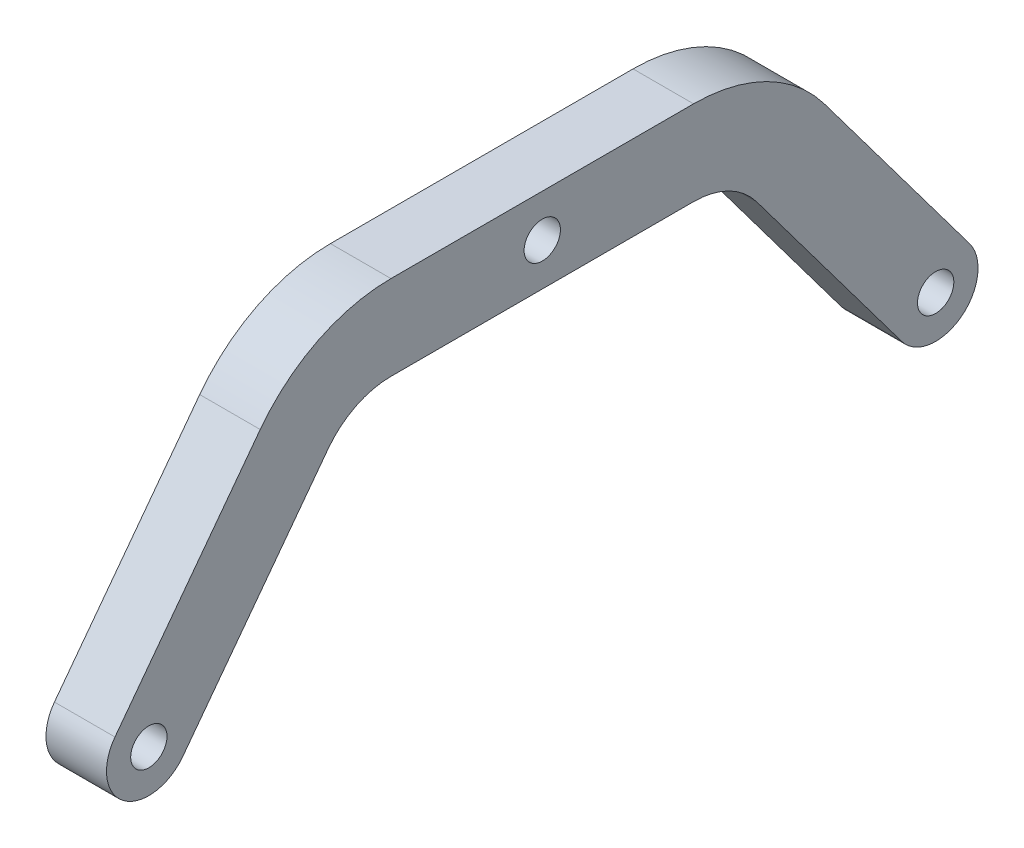
ISO-10303-21;
HEADER;
FILE_DESCRIPTION(('STEP AP214'),'2;1');
FILE_NAME('part.step','',(''),(''),'','','');
FILE_SCHEMA(('AUTOMOTIVE_DESIGN { 1 0 10303 214 1 1 1 1 }'));
ENDSEC;
DATA;
#1=APPLICATION_CONTEXT('core data for automotive mechanical design processes');
#2=APPLICATION_PROTOCOL_DEFINITION('international standard','automotive_design',2000,#1);
#3=PRODUCT_CONTEXT('',#1,'mechanical');
#4=PRODUCT('Part','Part','',(#3));
#5=PRODUCT_RELATED_PRODUCT_CATEGORY('part','',(#4));
#6=PRODUCT_DEFINITION_FORMATION('','',#4);
#7=PRODUCT_DEFINITION_CONTEXT('part definition',#1,'design');
#8=PRODUCT_DEFINITION('design','',#6,#7);
#9=PRODUCT_DEFINITION_SHAPE('','',#8);
#10=(LENGTH_UNIT() NAMED_UNIT(*) SI_UNIT(.MILLI.,.METRE.));
#11=(NAMED_UNIT(*) PLANE_ANGLE_UNIT() SI_UNIT($,.RADIAN.));
#12=(NAMED_UNIT(*) SI_UNIT($,.STERADIAN.) SOLID_ANGLE_UNIT());
#13=UNCERTAINTY_MEASURE_WITH_UNIT(LENGTH_MEASURE(1.E-05),#10,'distance_accuracy_value','');
#14=(GEOMETRIC_REPRESENTATION_CONTEXT(3) GLOBAL_UNCERTAINTY_ASSIGNED_CONTEXT((#13)) GLOBAL_UNIT_ASSIGNED_CONTEXT((#10,
#11,#12)) REPRESENTATION_CONTEXT('',''));
#15=CARTESIAN_POINT('',(0.,0.,0.));
#16=DIRECTION('',(0.,0.,1.));
#17=DIRECTION('',(1.,0.,0.));
#18=AXIS2_PLACEMENT_3D('',#15,#16,#17);
#19=CARTESIAN_POINT('',(2.5,9.99999999999999,-12.5));
#20=DIRECTION('',(-1.,0.,0.));
#21=DIRECTION('',(0.,0.,1.));
#22=AXIS2_PLACEMENT_3D('',#19,#20,#21);
#23=PLANE('',#22);
#24=CARTESIAN_POINT('',(2.5,9.99999999999999,-12.5));
#25=DIRECTION('',(1.,0.,0.));
#26=DIRECTION('',(0.,0.,1.));
#27=AXIS2_PLACEMENT_3D('',#24,#25,#26);
#28=CIRCLE('',#27,13.5);
#29=CARTESIAN_POINT('',(2.5,18.1,-23.3));
#30=VERTEX_POINT('',#29);
#31=CARTESIAN_POINT('',(2.5,23.5,-12.5));
#32=VERTEX_POINT('',#31);
#33=EDGE_CURVE('E181',#30,#32,#28,.T.);
#34=ORIENTED_EDGE('',*,*,#33,.T.);
#35=DIRECTION('',(0.,0.,1.));
#36=VECTOR('',#35,1.);
#37=CARTESIAN_POINT('',(2.5,23.5,12.5));
#38=LINE('',#37,#36);
#39=CARTESIAN_POINT('',(2.5,23.5,12.5));
#40=VERTEX_POINT('',#39);
#41=EDGE_CURVE('E109',#32,#40,#38,.T.);
#42=ORIENTED_EDGE('',*,*,#41,.T.);
#43=CARTESIAN_POINT('',(2.5,9.99999999999999,12.5));
#44=DIRECTION('',(1.,0.,0.));
#45=DIRECTION('',(0.,0.,-1.));
#46=AXIS2_PLACEMENT_3D('',#43,#44,#45);
#47=CIRCLE('',#46,13.5);
#48=CARTESIAN_POINT('',(2.5,18.1,23.3));
#49=VERTEX_POINT('',#48);
#50=EDGE_CURVE('E208',#40,#49,#47,.T.);
#51=ORIENTED_EDGE('',*,*,#50,.T.);
#52=DIRECTION('',(0.,-0.8,0.6));
#53=VECTOR('',#52,1.);
#54=CARTESIAN_POINT('',(2.5,18.1,23.3));
#55=LINE('',#54,#53);
#56=CARTESIAN_POINT('',(2.5,2.1,35.3));
#57=VERTEX_POINT('',#56);
#58=EDGE_CURVE('E227',#49,#57,#55,.T.);
#59=ORIENTED_EDGE('',*,*,#58,.T.);
#60=CARTESIAN_POINT('',(2.5,0.,32.5));
#61=DIRECTION('',(1.,0.,0.));
#62=DIRECTION('',(0.,0.,-1.));
#63=AXIS2_PLACEMENT_3D('',#60,#61,#62);
#64=CIRCLE('',#63,3.5);
#65=CARTESIAN_POINT('',(2.5,-2.1,29.7));
#66=VERTEX_POINT('',#65);
#67=EDGE_CURVE('E224',#57,#66,#64,.T.);
#68=ORIENTED_EDGE('',*,*,#67,.T.);
#69=DIRECTION('',(0.,0.8,-0.6));
#70=VECTOR('',#69,1.);
#71=CARTESIAN_POINT('',(2.5,13.9,17.7));
#72=LINE('',#71,#70);
#73=CARTESIAN_POINT('',(2.5,13.9,17.7));
#74=VERTEX_POINT('',#73);
#75=EDGE_CURVE('E226',#66,#74,#72,.T.);
#76=ORIENTED_EDGE('',*,*,#75,.T.);
#77=CARTESIAN_POINT('',(2.5,9.99999999999999,12.5));
#78=DIRECTION('',(-1.,0.,0.));
#79=DIRECTION('',(0.,0.,-1.));
#80=AXIS2_PLACEMENT_3D('',#77,#78,#79);
#81=CIRCLE('',#80,6.50000000000001);
#82=CARTESIAN_POINT('',(2.5,16.5,12.5));
#83=VERTEX_POINT('',#82);
#84=EDGE_CURVE('E229',#74,#83,#81,.T.);
#85=ORIENTED_EDGE('',*,*,#84,.T.);
#86=DIRECTION('',(0.,0.,-1.));
#87=VECTOR('',#86,1.);
#88=CARTESIAN_POINT('',(2.5,16.5,12.5));
#89=LINE('',#88,#87);
#90=CARTESIAN_POINT('',(2.5,16.5,-12.5));
#91=VERTEX_POINT('',#90);
#92=EDGE_CURVE('E235',#83,#91,#89,.T.);
#93=ORIENTED_EDGE('',*,*,#92,.T.);
#94=CARTESIAN_POINT('',(2.5,9.99999999999999,-12.5));
#95=DIRECTION('',(-1.,0.,0.));
#96=DIRECTION('',(0.,0.,1.));
#97=AXIS2_PLACEMENT_3D('',#94,#95,#96);
#98=CIRCLE('',#97,6.5);
#99=CARTESIAN_POINT('',(2.5,13.9,-17.7));
#100=VERTEX_POINT('',#99);
#101=EDGE_CURVE('E140',#91,#100,#98,.T.);
#102=ORIENTED_EDGE('',*,*,#101,.T.);
#103=DIRECTION('',(0.,-0.8,-0.6));
#104=VECTOR('',#103,1.);
#105=CARTESIAN_POINT('',(2.5,13.9,-17.7));
#106=LINE('',#105,#104);
#107=CARTESIAN_POINT('',(2.5,-2.1,-29.7));
#108=VERTEX_POINT('',#107);
#109=EDGE_CURVE('E134',#100,#108,#106,.T.);
#110=ORIENTED_EDGE('',*,*,#109,.T.);
#111=CARTESIAN_POINT('',(2.5,0.,-32.5));
#112=DIRECTION('',(1.,0.,0.));
#113=DIRECTION('',(0.,0.,1.));
#114=AXIS2_PLACEMENT_3D('',#111,#112,#113);
#115=CIRCLE('',#114,3.5);
#116=CARTESIAN_POINT('',(2.5,2.1,-35.3));
#117=VERTEX_POINT('',#116);
#118=EDGE_CURVE('E138',#108,#117,#115,.T.);
#119=ORIENTED_EDGE('',*,*,#118,.T.);
#120=DIRECTION('',(0.,0.8,0.6));
#121=VECTOR('',#120,1.);
#122=CARTESIAN_POINT('',(2.5,18.1,-23.3));
#123=LINE('',#122,#121);
#124=EDGE_CURVE('E54',#117,#30,#123,.T.);
#125=ORIENTED_EDGE('',*,*,#124,.T.);
#126=EDGE_LOOP('',(#34,#42,#51,#59,#68,#76,#85,#93,#102,#110,#119,#125));
#127=FACE_BOUND('',#126,.T.);
#128=CARTESIAN_POINT('',(2.5,0.,-32.5));
#129=DIRECTION('',(1.,0.,0.));
#130=DIRECTION('',(0.,0.,-1.));
#131=AXIS2_PLACEMENT_3D('',#128,#129,#130);
#132=CIRCLE('',#131,1.5);
#133=CARTESIAN_POINT('',(2.5,0.,-34.));
#134=VERTEX_POINT('',#133);
#135=EDGE_CURVE('E162',#134,#134,#132,.T.);
#136=ORIENTED_EDGE('',*,*,#135,.F.);
#137=EDGE_LOOP('',(#136));
#138=FACE_BOUND('',#137,.T.);
#139=CARTESIAN_POINT('',(2.5,0.,32.5));
#140=DIRECTION('',(1.,0.,0.));
#141=DIRECTION('',(0.,0.,-1.));
#142=AXIS2_PLACEMENT_3D('',#139,#140,#141);
#143=CIRCLE('',#142,1.5);
#144=CARTESIAN_POINT('',(2.5,0.,31.));
#145=VERTEX_POINT('',#144);
#146=EDGE_CURVE('E289',#145,#145,#143,.T.);
#147=ORIENTED_EDGE('',*,*,#146,.F.);
#148=EDGE_LOOP('',(#147));
#149=FACE_BOUND('',#148,.T.);
#150=CARTESIAN_POINT('',(2.5,20.,0.));
#151=DIRECTION('',(1.,0.,0.));
#152=DIRECTION('',(0.,0.,-1.));
#153=AXIS2_PLACEMENT_3D('',#150,#151,#152);
#154=CIRCLE('',#153,1.5);
#155=CARTESIAN_POINT('',(2.5,20.,-1.5));
#156=VERTEX_POINT('',#155);
#157=EDGE_CURVE('E280',#156,#156,#154,.T.);
#158=ORIENTED_EDGE('',*,*,#157,.F.);
#159=EDGE_LOOP('',(#158));
#160=FACE_BOUND('',#159,.T.);
#161=ADVANCED_FACE('F37',(#127,#138,#149,#160),#23,.F.);
#162=CARTESIAN_POINT('',(-2.5,9.99999999999999,-12.5));
#163=DIRECTION('',(-1.,0.,0.));
#164=DIRECTION('',(0.,0.,1.));
#165=AXIS2_PLACEMENT_3D('',#162,#163,#164);
#166=PLANE('',#165);
#167=CARTESIAN_POINT('',(-2.5,0.,32.5));
#168=DIRECTION('',(1.,0.,0.));
#169=DIRECTION('',(0.,0.,-1.));
#170=AXIS2_PLACEMENT_3D('',#167,#168,#169);
#171=CIRCLE('',#170,1.5);
#172=CARTESIAN_POINT('',(-2.5,0.,31.));
#173=VERTEX_POINT('',#172);
#174=EDGE_CURVE('E286',#173,#173,#171,.T.);
#175=ORIENTED_EDGE('',*,*,#174,.T.);
#176=EDGE_LOOP('',(#175));
#177=FACE_BOUND('',#176,.T.);
#178=CARTESIAN_POINT('',(-2.5,9.99999999999999,-12.5));
#179=DIRECTION('',(1.,0.,0.));
#180=DIRECTION('',(0.,0.,1.));
#181=AXIS2_PLACEMENT_3D('',#178,#179,#180);
#182=CIRCLE('',#181,13.5);
#183=CARTESIAN_POINT('',(-2.5,18.1,-23.3));
#184=VERTEX_POINT('',#183);
#185=CARTESIAN_POINT('',(-2.5,23.5,-12.5));
#186=VERTEX_POINT('',#185);
#187=EDGE_CURVE('E158',#184,#186,#182,.T.);
#188=ORIENTED_EDGE('',*,*,#187,.F.);
#189=DIRECTION('',(0.,0.8,0.6));
#190=VECTOR('',#189,1.);
#191=CARTESIAN_POINT('',(-2.5,18.1,-23.3));
#192=LINE('',#191,#190);
#193=CARTESIAN_POINT('',(-2.5,2.1,-35.3));
#194=VERTEX_POINT('',#193);
#195=EDGE_CURVE('E101',#194,#184,#192,.T.);
#196=ORIENTED_EDGE('',*,*,#195,.F.);
#197=CARTESIAN_POINT('',(-2.5,0.,-32.5));
#198=DIRECTION('',(1.,0.,0.));
#199=DIRECTION('',(0.,0.,1.));
#200=AXIS2_PLACEMENT_3D('',#197,#198,#199);
#201=CIRCLE('',#200,3.5);
#202=CARTESIAN_POINT('',(-2.5,-2.1,-29.7));
#203=VERTEX_POINT('',#202);
#204=EDGE_CURVE('E95',#203,#194,#201,.T.);
#205=ORIENTED_EDGE('',*,*,#204,.F.);
#206=DIRECTION('',(0.,-0.8,-0.6));
#207=VECTOR('',#206,1.);
#208=CARTESIAN_POINT('',(-2.5,13.9,-17.7));
#209=LINE('',#208,#207);
#210=CARTESIAN_POINT('',(-2.5,13.9,-17.7));
#211=VERTEX_POINT('',#210);
#212=EDGE_CURVE('E148',#211,#203,#209,.T.);
#213=ORIENTED_EDGE('',*,*,#212,.F.);
#214=CARTESIAN_POINT('',(-2.5,9.99999999999999,-12.5));
#215=DIRECTION('',(-1.,0.,0.));
#216=DIRECTION('',(0.,0.,1.));
#217=AXIS2_PLACEMENT_3D('',#214,#215,#216);
#218=CIRCLE('',#217,6.5);
#219=CARTESIAN_POINT('',(-2.5,16.5,-12.5));
#220=VERTEX_POINT('',#219);
#221=EDGE_CURVE('E176',#220,#211,#218,.T.);
#222=ORIENTED_EDGE('',*,*,#221,.F.);
#223=DIRECTION('',(0.,0.,-1.));
#224=VECTOR('',#223,1.);
#225=CARTESIAN_POINT('',(-2.5,16.5,12.5));
#226=LINE('',#225,#224);
#227=CARTESIAN_POINT('',(-2.5,16.5,12.5));
#228=VERTEX_POINT('',#227);
#229=EDGE_CURVE('E174',#228,#220,#226,.T.);
#230=ORIENTED_EDGE('',*,*,#229,.F.);
#231=CARTESIAN_POINT('',(-2.5,9.99999999999999,12.5));
#232=DIRECTION('',(-1.,0.,0.));
#233=DIRECTION('',(0.,0.,-1.));
#234=AXIS2_PLACEMENT_3D('',#231,#232,#233);
#235=CIRCLE('',#234,6.50000000000001);
#236=CARTESIAN_POINT('',(-2.5,13.9,17.7));
#237=VERTEX_POINT('',#236);
#238=EDGE_CURVE('E172',#237,#228,#235,.T.);
#239=ORIENTED_EDGE('',*,*,#238,.F.);
#240=DIRECTION('',(0.,0.8,-0.6));
#241=VECTOR('',#240,1.);
#242=CARTESIAN_POINT('',(-2.5,13.9,17.7));
#243=LINE('',#242,#241);
#244=CARTESIAN_POINT('',(-2.5,-2.1,29.7));
#245=VERTEX_POINT('',#244);
#246=EDGE_CURVE('E170',#245,#237,#243,.T.);
#247=ORIENTED_EDGE('',*,*,#246,.F.);
#248=CARTESIAN_POINT('',(-2.5,0.,32.5));
#249=DIRECTION('',(1.,0.,0.));
#250=DIRECTION('',(0.,0.,-1.));
#251=AXIS2_PLACEMENT_3D('',#248,#249,#250);
#252=CIRCLE('',#251,3.5);
#253=CARTESIAN_POINT('',(-2.5,2.1,35.3));
#254=VERTEX_POINT('',#253);
#255=EDGE_CURVE('E168',#254,#245,#252,.T.);
#256=ORIENTED_EDGE('',*,*,#255,.F.);
#257=DIRECTION('',(0.,-0.8,0.6));
#258=VECTOR('',#257,1.);
#259=CARTESIAN_POINT('',(-2.5,18.1,23.3));
#260=LINE('',#259,#258);
#261=CARTESIAN_POINT('',(-2.5,18.1,23.3));
#262=VERTEX_POINT('',#261);
#263=EDGE_CURVE('E166',#262,#254,#260,.T.);
#264=ORIENTED_EDGE('',*,*,#263,.F.);
#265=CARTESIAN_POINT('',(-2.5,9.99999999999999,12.5));
#266=DIRECTION('',(1.,0.,0.));
#267=DIRECTION('',(0.,0.,-1.));
#268=AXIS2_PLACEMENT_3D('',#265,#266,#267);
#269=CIRCLE('',#268,13.5);
#270=CARTESIAN_POINT('',(-2.5,23.5,12.5));
#271=VERTEX_POINT('',#270);
#272=EDGE_CURVE('E164',#271,#262,#269,.T.);
#273=ORIENTED_EDGE('',*,*,#272,.F.);
#274=DIRECTION('',(0.,0.,1.));
#275=VECTOR('',#274,1.);
#276=CARTESIAN_POINT('',(-2.5,23.5,12.5));
#277=LINE('',#276,#275);
#278=EDGE_CURVE('E161',#186,#271,#277,.T.);
#279=ORIENTED_EDGE('',*,*,#278,.F.);
#280=EDGE_LOOP('',(#188,#196,#205,#213,#222,#230,#239,#247,#256,#264,#273,#279));
#281=FACE_BOUND('',#280,.T.);
#282=CARTESIAN_POINT('',(-2.5,0.,-32.5));
#283=DIRECTION('',(1.,0.,0.));
#284=DIRECTION('',(0.,0.,-1.));
#285=AXIS2_PLACEMENT_3D('',#282,#283,#284);
#286=CIRCLE('',#285,1.5);
#287=CARTESIAN_POINT('',(-2.5,0.,-34.));
#288=VERTEX_POINT('',#287);
#289=EDGE_CURVE('E292',#288,#288,#286,.T.);
#290=ORIENTED_EDGE('',*,*,#289,.T.);
#291=EDGE_LOOP('',(#290));
#292=FACE_BOUND('',#291,.T.);
#293=CARTESIAN_POINT('',(-2.5,20.,0.));
#294=DIRECTION('',(1.,0.,0.));
#295=DIRECTION('',(0.,0.,-1.));
#296=AXIS2_PLACEMENT_3D('',#293,#294,#295);
#297=CIRCLE('',#296,1.5);
#298=CARTESIAN_POINT('',(-2.5,20.,-1.5));
#299=VERTEX_POINT('',#298);
#300=EDGE_CURVE('E283',#299,#299,#297,.T.);
#301=ORIENTED_EDGE('',*,*,#300,.T.);
#302=EDGE_LOOP('',(#301));
#303=FACE_BOUND('',#302,.T.);
#304=ADVANCED_FACE('F212',(#177,#281,#292,#303),#166,.T.);
#305=CARTESIAN_POINT('',(2.5,9.99999999999999,-12.5));
#306=DIRECTION('',(-1.,0.,0.));
#307=DIRECTION('',(0.,0.,1.));
#308=AXIS2_PLACEMENT_3D('',#305,#306,#307);
#309=CYLINDRICAL_SURFACE('',#308,13.5);
#310=ORIENTED_EDGE('',*,*,#187,.T.);
#311=DIRECTION('',(-1.,0.,0.));
#312=VECTOR('',#311,1.);
#313=CARTESIAN_POINT('',(2.5,23.5,-12.5));
#314=LINE('',#313,#312);
#315=EDGE_CURVE('E11',#32,#186,#314,.T.);
#316=ORIENTED_EDGE('',*,*,#315,.F.);
#317=ORIENTED_EDGE('',*,*,#33,.F.);
#318=DIRECTION('',(-1.,0.,0.));
#319=VECTOR('',#318,1.);
#320=CARTESIAN_POINT('',(2.5,18.1,-23.3));
#321=LINE('',#320,#319);
#322=EDGE_CURVE('E154',#30,#184,#321,.T.);
#323=ORIENTED_EDGE('',*,*,#322,.T.);
#324=EDGE_LOOP('',(#310,#316,#317,#323));
#325=FACE_BOUND('',#324,.T.);
#326=ADVANCED_FACE('F39',(#325),#309,.T.);
#327=CARTESIAN_POINT('',(2.5,23.5,12.5));
#328=DIRECTION('',(0.,-1.,0.));
#329=DIRECTION('',(0.,0.,-1.));
#330=AXIS2_PLACEMENT_3D('',#327,#328,#329);
#331=PLANE('',#330);
#332=ORIENTED_EDGE('',*,*,#278,.T.);
#333=DIRECTION('',(-1.,0.,0.));
#334=VECTOR('',#333,1.);
#335=CARTESIAN_POINT('',(2.5,23.5,12.5));
#336=LINE('',#335,#334);
#337=EDGE_CURVE('E46',#40,#271,#336,.T.);
#338=ORIENTED_EDGE('',*,*,#337,.F.);
#339=ORIENTED_EDGE('',*,*,#41,.F.);
#340=ORIENTED_EDGE('',*,*,#315,.T.);
#341=EDGE_LOOP('',(#332,#338,#339,#340));
#342=FACE_BOUND('',#341,.T.);
#343=ADVANCED_FACE('F405',(#342),#331,.F.);
#344=CARTESIAN_POINT('',(2.5,9.99999999999999,12.5));
#345=DIRECTION('',(-1.,0.,0.));
#346=DIRECTION('',(0.,0.,1.));
#347=AXIS2_PLACEMENT_3D('',#344,#345,#346);
#348=CYLINDRICAL_SURFACE('',#347,13.5);
#349=ORIENTED_EDGE('',*,*,#272,.T.);
#350=DIRECTION('',(-1.,0.,0.));
#351=VECTOR('',#350,1.);
#352=CARTESIAN_POINT('',(2.5,18.1,23.3));
#353=LINE('',#352,#351);
#354=EDGE_CURVE('E200',#49,#262,#353,.T.);
#355=ORIENTED_EDGE('',*,*,#354,.F.);
#356=ORIENTED_EDGE('',*,*,#50,.F.);
#357=ORIENTED_EDGE('',*,*,#337,.T.);
#358=EDGE_LOOP('',(#349,#355,#356,#357));
#359=FACE_BOUND('',#358,.T.);
#360=ADVANCED_FACE('F206',(#359),#348,.T.);
#361=CARTESIAN_POINT('',(2.5,18.1,23.3));
#362=DIRECTION('',(0.,-0.6,-0.8));
#363=DIRECTION('',(0.,0.8,-0.6));
#364=AXIS2_PLACEMENT_3D('',#361,#362,#363);
#365=PLANE('',#364);
#366=ORIENTED_EDGE('',*,*,#263,.T.);
#367=DIRECTION('',(-1.,0.,0.));
#368=VECTOR('',#367,1.);
#369=CARTESIAN_POINT('',(2.5,2.1,35.3));
#370=LINE('',#369,#368);
#371=EDGE_CURVE('E197',#57,#254,#370,.T.);
#372=ORIENTED_EDGE('',*,*,#371,.F.);
#373=ORIENTED_EDGE('',*,*,#58,.F.);
#374=ORIENTED_EDGE('',*,*,#354,.T.);
#375=EDGE_LOOP('',(#366,#372,#373,#374));
#376=FACE_BOUND('',#375,.T.);
#377=ADVANCED_FACE('F218',(#376),#365,.F.);
#378=CARTESIAN_POINT('',(2.5,0.,32.5));
#379=DIRECTION('',(-1.,0.,0.));
#380=DIRECTION('',(0.,0.,1.));
#381=AXIS2_PLACEMENT_3D('',#378,#379,#380);
#382=CYLINDRICAL_SURFACE('',#381,3.5);
#383=ORIENTED_EDGE('',*,*,#255,.T.);
#384=DIRECTION('',(-1.,0.,0.));
#385=VECTOR('',#384,1.);
#386=CARTESIAN_POINT('',(2.5,-2.1,29.7));
#387=LINE('',#386,#385);
#388=EDGE_CURVE('E194',#66,#245,#387,.T.);
#389=ORIENTED_EDGE('',*,*,#388,.F.);
#390=ORIENTED_EDGE('',*,*,#67,.F.);
#391=ORIENTED_EDGE('',*,*,#371,.T.);
#392=EDGE_LOOP('',(#383,#389,#390,#391));
#393=FACE_BOUND('',#392,.T.);
#394=ADVANCED_FACE('F222',(#393),#382,.T.);
#395=CARTESIAN_POINT('',(2.5,13.9,17.7));
#396=DIRECTION('',(0.,0.6,0.8));
#397=DIRECTION('',(0.,-0.8,0.6));
#398=AXIS2_PLACEMENT_3D('',#395,#396,#397);
#399=PLANE('',#398);
#400=ORIENTED_EDGE('',*,*,#246,.T.);
#401=DIRECTION('',(-1.,0.,0.));
#402=VECTOR('',#401,1.);
#403=CARTESIAN_POINT('',(2.5,13.9,17.7));
#404=LINE('',#403,#402);
#405=EDGE_CURVE('E191',#74,#237,#404,.T.);
#406=ORIENTED_EDGE('',*,*,#405,.F.);
#407=ORIENTED_EDGE('',*,*,#75,.F.);
#408=ORIENTED_EDGE('',*,*,#388,.T.);
#409=EDGE_LOOP('',(#400,#406,#407,#408));
#410=FACE_BOUND('',#409,.T.);
#411=ADVANCED_FACE('F366',(#410),#399,.F.);
#412=CARTESIAN_POINT('',(2.5,9.99999999999999,12.5));
#413=DIRECTION('',(-1.,0.,0.));
#414=DIRECTION('',(0.,0.,1.));
#415=AXIS2_PLACEMENT_3D('',#412,#413,#414);
#416=CYLINDRICAL_SURFACE('',#415,6.50000000000001);
#417=ORIENTED_EDGE('',*,*,#238,.T.);
#418=DIRECTION('',(-1.,0.,0.));
#419=VECTOR('',#418,1.);
#420=CARTESIAN_POINT('',(2.5,16.5,12.5));
#421=LINE('',#420,#419);
#422=EDGE_CURVE('E188',#83,#228,#421,.T.);
#423=ORIENTED_EDGE('',*,*,#422,.F.);
#424=ORIENTED_EDGE('',*,*,#84,.F.);
#425=ORIENTED_EDGE('',*,*,#405,.T.);
#426=EDGE_LOOP('',(#417,#423,#424,#425));
#427=FACE_BOUND('',#426,.T.);
#428=ADVANCED_FACE('F356',(#427),#416,.F.);
#429=CARTESIAN_POINT('',(2.5,16.5,12.5));
#430=DIRECTION('',(0.,1.,0.));
#431=DIRECTION('',(0.,0.,1.));
#432=AXIS2_PLACEMENT_3D('',#429,#430,#431);
#433=PLANE('',#432);
#434=ORIENTED_EDGE('',*,*,#229,.T.);
#435=DIRECTION('',(-1.,0.,0.));
#436=VECTOR('',#435,1.);
#437=CARTESIAN_POINT('',(2.5,16.5,-12.5));
#438=LINE('',#437,#436);
#439=EDGE_CURVE('E185',#91,#220,#438,.T.);
#440=ORIENTED_EDGE('',*,*,#439,.F.);
#441=ORIENTED_EDGE('',*,*,#92,.F.);
#442=ORIENTED_EDGE('',*,*,#422,.T.);
#443=EDGE_LOOP('',(#434,#440,#441,#442));
#444=FACE_BOUND('',#443,.T.);
#445=ADVANCED_FACE('F241',(#444),#433,.F.);
#446=CARTESIAN_POINT('',(2.5,9.99999999999999,-12.5));
#447=DIRECTION('',(-1.,0.,0.));
#448=DIRECTION('',(0.,0.,1.));
#449=AXIS2_PLACEMENT_3D('',#446,#447,#448);
#450=CYLINDRICAL_SURFACE('',#449,6.5);
#451=ORIENTED_EDGE('',*,*,#221,.T.);
#452=DIRECTION('',(-1.,0.,0.));
#453=VECTOR('',#452,1.);
#454=CARTESIAN_POINT('',(2.5,13.9,-17.7));
#455=LINE('',#454,#453);
#456=EDGE_CURVE('E149',#100,#211,#455,.T.);
#457=ORIENTED_EDGE('',*,*,#456,.F.);
#458=ORIENTED_EDGE('',*,*,#101,.F.);
#459=ORIENTED_EDGE('',*,*,#439,.T.);
#460=EDGE_LOOP('',(#451,#457,#458,#459));
#461=FACE_BOUND('',#460,.T.);
#462=ADVANCED_FACE('F245',(#461),#450,.F.);
#463=CARTESIAN_POINT('',(2.5,13.9,-17.7));
#464=DIRECTION('',(0.,0.6,-0.8));
#465=DIRECTION('',(0.,0.8,0.6));
#466=AXIS2_PLACEMENT_3D('',#463,#464,#465);
#467=PLANE('',#466);
#468=ORIENTED_EDGE('',*,*,#212,.T.);
#469=DIRECTION('',(-1.,0.,0.));
#470=VECTOR('',#469,1.);
#471=CARTESIAN_POINT('',(2.5,-2.1,-29.7));
#472=LINE('',#471,#470);
#473=EDGE_CURVE('E145',#108,#203,#472,.T.);
#474=ORIENTED_EDGE('',*,*,#473,.F.);
#475=ORIENTED_EDGE('',*,*,#109,.F.);
#476=ORIENTED_EDGE('',*,*,#456,.T.);
#477=EDGE_LOOP('',(#468,#474,#475,#476));
#478=FACE_BOUND('',#477,.T.);
#479=ADVANCED_FACE('F146',(#478),#467,.F.);
#480=CARTESIAN_POINT('',(2.5,0.,-32.5));
#481=DIRECTION('',(-1.,0.,0.));
#482=DIRECTION('',(0.,0.,1.));
#483=AXIS2_PLACEMENT_3D('',#480,#481,#482);
#484=CYLINDRICAL_SURFACE('',#483,3.5);
#485=ORIENTED_EDGE('',*,*,#204,.T.);
#486=DIRECTION('',(-1.,0.,0.));
#487=VECTOR('',#486,1.);
#488=CARTESIAN_POINT('',(2.5,2.1,-35.3));
#489=LINE('',#488,#487);
#490=EDGE_CURVE('E150',#117,#194,#489,.T.);
#491=ORIENTED_EDGE('',*,*,#490,.F.);
#492=ORIENTED_EDGE('',*,*,#118,.F.);
#493=ORIENTED_EDGE('',*,*,#473,.T.);
#494=EDGE_LOOP('',(#485,#491,#492,#493));
#495=FACE_BOUND('',#494,.T.);
#496=ADVANCED_FACE('F152',(#495),#484,.T.);
#497=CARTESIAN_POINT('',(2.5,18.1,-23.3));
#498=DIRECTION('',(0.,-0.6,0.8));
#499=DIRECTION('',(0.,-0.8,-0.6));
#500=AXIS2_PLACEMENT_3D('',#497,#498,#499);
#501=PLANE('',#500);
#502=ORIENTED_EDGE('',*,*,#195,.T.);
#503=ORIENTED_EDGE('',*,*,#322,.F.);
#504=ORIENTED_EDGE('',*,*,#124,.F.);
#505=ORIENTED_EDGE('',*,*,#490,.T.);
#506=EDGE_LOOP('',(#502,#503,#504,#505));
#507=FACE_BOUND('',#506,.T.);
#508=ADVANCED_FACE('F249',(#507),#501,.F.);
#509=CARTESIAN_POINT('',(2.5,0.,-32.5));
#510=DIRECTION('',(-1.,0.,0.));
#511=DIRECTION('',(0.,0.,1.));
#512=AXIS2_PLACEMENT_3D('',#509,#510,#511);
#513=CYLINDRICAL_SURFACE('',#512,1.5);
#514=ORIENTED_EDGE('',*,*,#135,.T.);
#515=EDGE_LOOP('',(#514));
#516=FACE_BOUND('',#515,.T.);
#517=ORIENTED_EDGE('',*,*,#289,.F.);
#518=EDGE_LOOP('',(#517));
#519=FACE_BOUND('',#518,.T.);
#520=ADVANCED_FACE('F251',(#516,#519),#513,.F.);
#521=CARTESIAN_POINT('',(2.5,0.,32.5));
#522=DIRECTION('',(-1.,0.,0.));
#523=DIRECTION('',(0.,0.,1.));
#524=AXIS2_PLACEMENT_3D('',#521,#522,#523);
#525=CYLINDRICAL_SURFACE('',#524,1.5);
#526=ORIENTED_EDGE('',*,*,#146,.T.);
#527=EDGE_LOOP('',(#526));
#528=FACE_BOUND('',#527,.T.);
#529=ORIENTED_EDGE('',*,*,#174,.F.);
#530=EDGE_LOOP('',(#529));
#531=FACE_BOUND('',#530,.T.);
#532=ADVANCED_FACE('F257',(#528,#531),#525,.F.);
#533=CARTESIAN_POINT('',(2.5,20.,0.));
#534=DIRECTION('',(-1.,0.,0.));
#535=DIRECTION('',(0.,0.,1.));
#536=AXIS2_PLACEMENT_3D('',#533,#534,#535);
#537=CYLINDRICAL_SURFACE('',#536,1.5);
#538=ORIENTED_EDGE('',*,*,#157,.T.);
#539=EDGE_LOOP('',(#538));
#540=FACE_BOUND('',#539,.T.);
#541=ORIENTED_EDGE('',*,*,#300,.F.);
#542=EDGE_LOOP('',(#541));
#543=FACE_BOUND('',#542,.T.);
#544=ADVANCED_FACE('F271',(#540,#543),#537,.F.);
#545=CLOSED_SHELL('',(#161,#304,#326,#343,#360,#377,#394,#411,#428,#445,#462,#479,#496,#508,
#520,#532,#544));
#546=MANIFOLD_SOLID_BREP('B2',#545);
#547=ADVANCED_BREP_SHAPE_REPRESENTATION('',(#18,#546),#14);
#548=SHAPE_DEFINITION_REPRESENTATION(#9,#547);
ENDSEC;
END-ISO-10303-21;
